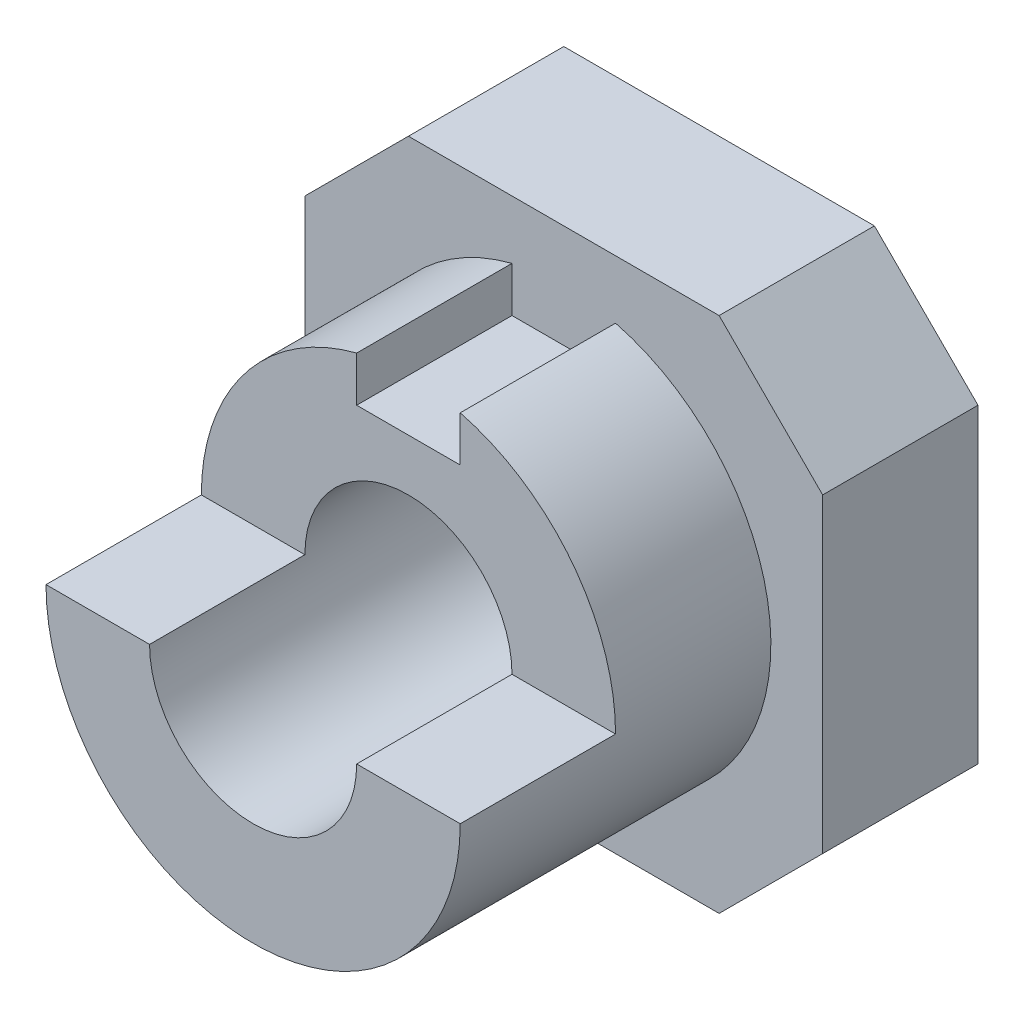
ISO-10303-21;
HEADER;
FILE_DESCRIPTION(('STEP AP214'),'2;1');
FILE_NAME('part.step','',(''),(''),'','','');
FILE_SCHEMA(('AUTOMOTIVE_DESIGN { 1 0 10303 214 1 1 1 1 }'));
ENDSEC;
DATA;
#1=APPLICATION_CONTEXT('core data for automotive mechanical design processes');
#2=APPLICATION_PROTOCOL_DEFINITION('international standard','automotive_design',2000,#1);
#3=PRODUCT_CONTEXT('',#1,'mechanical');
#4=PRODUCT('Part','Part','',(#3));
#5=PRODUCT_RELATED_PRODUCT_CATEGORY('part','',(#4));
#6=PRODUCT_DEFINITION_FORMATION('','',#4);
#7=PRODUCT_DEFINITION_CONTEXT('part definition',#1,'design');
#8=PRODUCT_DEFINITION('design','',#6,#7);
#9=PRODUCT_DEFINITION_SHAPE('','',#8);
#10=(LENGTH_UNIT() NAMED_UNIT(*) SI_UNIT(.MILLI.,.METRE.));
#11=(NAMED_UNIT(*) PLANE_ANGLE_UNIT() SI_UNIT($,.RADIAN.));
#12=(NAMED_UNIT(*) SI_UNIT($,.STERADIAN.) SOLID_ANGLE_UNIT());
#13=UNCERTAINTY_MEASURE_WITH_UNIT(LENGTH_MEASURE(1.E-05),#10,'distance_accuracy_value','');
#14=(GEOMETRIC_REPRESENTATION_CONTEXT(3) GLOBAL_UNCERTAINTY_ASSIGNED_CONTEXT((#13)) GLOBAL_UNIT_ASSIGNED_CONTEXT((#10,
#11,#12)) REPRESENTATION_CONTEXT('',''));
#15=CARTESIAN_POINT('',(0.,0.,0.));
#16=DIRECTION('',(0.,0.,1.));
#17=DIRECTION('',(1.,0.,0.));
#18=AXIS2_PLACEMENT_3D('',#15,#16,#17);
#19=CARTESIAN_POINT('',(0.,0.,3.));
#20=DIRECTION('',(0.,0.,-1.));
#21=DIRECTION('',(-1.,0.,0.));
#22=AXIS2_PLACEMENT_3D('',#19,#20,#21);
#23=PLANE('',#22);
#24=DIRECTION('',(0.,-1.,0.));
#25=VECTOR('',#24,1.);
#26=CARTESIAN_POINT('',(-5.,-3.,3.));
#27=LINE('',#26,#25);
#28=CARTESIAN_POINT('',(-5.,3.,3.));
#29=VERTEX_POINT('',#28);
#30=CARTESIAN_POINT('',(-5.,-3.,3.));
#31=VERTEX_POINT('',#30);
#32=EDGE_CURVE('E210',#29,#31,#27,.T.);
#33=ORIENTED_EDGE('',*,*,#32,.T.);
#34=DIRECTION('',(0.707106781186548,-0.707106781186548,0.));
#35=VECTOR('',#34,1.);
#36=CARTESIAN_POINT('',(-5.,-3.,3.));
#37=LINE('',#36,#35);
#38=CARTESIAN_POINT('',(-3.,-5.,3.));
#39=VERTEX_POINT('',#38);
#40=EDGE_CURVE('E213',#31,#39,#37,.T.);
#41=ORIENTED_EDGE('',*,*,#40,.T.);
#42=DIRECTION('',(1.,0.,0.));
#43=VECTOR('',#42,1.);
#44=CARTESIAN_POINT('',(-3.,-5.,3.));
#45=LINE('',#44,#43);
#46=CARTESIAN_POINT('',(3.,-5.,3.));
#47=VERTEX_POINT('',#46);
#48=EDGE_CURVE('E216',#39,#47,#45,.T.);
#49=ORIENTED_EDGE('',*,*,#48,.T.);
#50=DIRECTION('',(0.707106781186548,0.707106781186548,0.));
#51=VECTOR('',#50,1.);
#52=CARTESIAN_POINT('',(3.,-5.,3.));
#53=LINE('',#52,#51);
#54=CARTESIAN_POINT('',(5.,-3.,3.));
#55=VERTEX_POINT('',#54);
#56=EDGE_CURVE('E218',#47,#55,#53,.T.);
#57=ORIENTED_EDGE('',*,*,#56,.T.);
#58=DIRECTION('',(0.,1.,0.));
#59=VECTOR('',#58,1.);
#60=CARTESIAN_POINT('',(5.,-3.,3.));
#61=LINE('',#60,#59);
#62=CARTESIAN_POINT('',(5.,3.,3.));
#63=VERTEX_POINT('',#62);
#64=EDGE_CURVE('E220',#55,#63,#61,.T.);
#65=ORIENTED_EDGE('',*,*,#64,.T.);
#66=DIRECTION('',(-0.707106781186548,0.707106781186548,0.));
#67=VECTOR('',#66,1.);
#68=CARTESIAN_POINT('',(3.,5.,3.));
#69=LINE('',#68,#67);
#70=CARTESIAN_POINT('',(3.,5.,3.));
#71=VERTEX_POINT('',#70);
#72=EDGE_CURVE('E222',#63,#71,#69,.T.);
#73=ORIENTED_EDGE('',*,*,#72,.T.);
#74=DIRECTION('',(-1.,0.,0.));
#75=VECTOR('',#74,1.);
#76=CARTESIAN_POINT('',(-3.,5.,3.));
#77=LINE('',#76,#75);
#78=CARTESIAN_POINT('',(-3.,5.,3.));
#79=VERTEX_POINT('',#78);
#80=EDGE_CURVE('E224',#71,#79,#77,.T.);
#81=ORIENTED_EDGE('',*,*,#80,.T.);
#82=DIRECTION('',(-0.707106781186548,-0.707106781186548,0.));
#83=VECTOR('',#82,1.);
#84=CARTESIAN_POINT('',(-5.,3.,3.));
#85=LINE('',#84,#83);
#86=EDGE_CURVE('E226',#79,#29,#85,.T.);
#87=ORIENTED_EDGE('',*,*,#86,.T.);
#88=EDGE_LOOP('',(#33,#41,#49,#57,#65,#73,#81,#87));
#89=FACE_BOUND('',#88,.T.);
#90=DIRECTION('',(0.,-1.,0.));
#91=VECTOR('',#90,1.);
#92=CARTESIAN_POINT('',(1.,3.,3.));
#93=LINE('',#92,#91);
#94=CARTESIAN_POINT('',(1.,3.87298334620742,3.));
#95=VERTEX_POINT('',#94);
#96=CARTESIAN_POINT('',(1.,3.,3.));
#97=VERTEX_POINT('',#96);
#98=EDGE_CURVE('E187',#95,#97,#93,.T.);
#99=ORIENTED_EDGE('',*,*,#98,.F.);
#100=CARTESIAN_POINT('',(0.,0.,3.));
#101=DIRECTION('',(0.,0.,1.));
#102=DIRECTION('',(1.,0.,0.));
#103=AXIS2_PLACEMENT_3D('',#100,#101,#102);
#104=CIRCLE('',#103,4.);
#105=CARTESIAN_POINT('',(-1.,3.87298334620742,3.));
#106=VERTEX_POINT('',#105);
#107=EDGE_CURVE('E189',#106,#95,#104,.T.);
#108=ORIENTED_EDGE('',*,*,#107,.F.);
#109=DIRECTION('',(0.,1.,0.));
#110=VECTOR('',#109,1.);
#111=CARTESIAN_POINT('',(-1.,3.,3.));
#112=LINE('',#111,#110);
#113=CARTESIAN_POINT('',(-1.,3.,3.));
#114=VERTEX_POINT('',#113);
#115=EDGE_CURVE('E194',#114,#106,#112,.T.);
#116=ORIENTED_EDGE('',*,*,#115,.F.);
#117=DIRECTION('',(-1.,0.,0.));
#118=VECTOR('',#117,1.);
#119=CARTESIAN_POINT('',(1.,3.,3.));
#120=LINE('',#119,#118);
#121=EDGE_CURVE('E191',#97,#114,#120,.T.);
#122=ORIENTED_EDGE('',*,*,#121,.F.);
#123=EDGE_LOOP('',(#99,#108,#116,#122));
#124=FACE_BOUND('',#123,.T.);
#125=ADVANCED_FACE('F33',(#89,#124),#23,.F.);
#126=CARTESIAN_POINT('',(0.,0.,0.));
#127=DIRECTION('',(0.,0.,-1.));
#128=DIRECTION('',(-1.,0.,0.));
#129=AXIS2_PLACEMENT_3D('',#126,#127,#128);
#130=PLANE('',#129);
#131=DIRECTION('',(0.,-1.,0.));
#132=VECTOR('',#131,1.);
#133=CARTESIAN_POINT('',(-5.,-3.,0.));
#134=LINE('',#133,#132);
#135=CARTESIAN_POINT('',(-5.,3.,0.));
#136=VERTEX_POINT('',#135);
#137=CARTESIAN_POINT('',(-5.,-3.,0.));
#138=VERTEX_POINT('',#137);
#139=EDGE_CURVE('E209',#136,#138,#134,.T.);
#140=ORIENTED_EDGE('',*,*,#139,.F.);
#141=DIRECTION('',(-0.707106781186548,-0.707106781186548,0.));
#142=VECTOR('',#141,1.);
#143=CARTESIAN_POINT('',(-5.,3.,0.));
#144=LINE('',#143,#142);
#145=CARTESIAN_POINT('',(-3.,5.,0.));
#146=VERTEX_POINT('',#145);
#147=EDGE_CURVE('E214',#146,#136,#144,.T.);
#148=ORIENTED_EDGE('',*,*,#147,.F.);
#149=DIRECTION('',(-1.,0.,0.));
#150=VECTOR('',#149,1.);
#151=CARTESIAN_POINT('',(-3.,5.,0.));
#152=LINE('',#151,#150);
#153=CARTESIAN_POINT('',(3.,5.,0.));
#154=VERTEX_POINT('',#153);
#155=EDGE_CURVE('E241',#154,#146,#152,.T.);
#156=ORIENTED_EDGE('',*,*,#155,.F.);
#157=DIRECTION('',(-0.707106781186548,0.707106781186548,0.));
#158=VECTOR('',#157,1.);
#159=CARTESIAN_POINT('',(3.,5.,0.));
#160=LINE('',#159,#158);
#161=CARTESIAN_POINT('',(5.,3.,0.));
#162=VERTEX_POINT('',#161);
#163=EDGE_CURVE('E239',#162,#154,#160,.T.);
#164=ORIENTED_EDGE('',*,*,#163,.F.);
#165=DIRECTION('',(0.,1.,0.));
#166=VECTOR('',#165,1.);
#167=CARTESIAN_POINT('',(5.,-3.,0.));
#168=LINE('',#167,#166);
#169=CARTESIAN_POINT('',(5.,-3.,0.));
#170=VERTEX_POINT('',#169);
#171=EDGE_CURVE('E237',#170,#162,#168,.T.);
#172=ORIENTED_EDGE('',*,*,#171,.F.);
#173=DIRECTION('',(0.707106781186548,0.707106781186548,0.));
#174=VECTOR('',#173,1.);
#175=CARTESIAN_POINT('',(3.,-5.,0.));
#176=LINE('',#175,#174);
#177=CARTESIAN_POINT('',(3.,-5.,0.));
#178=VERTEX_POINT('',#177);
#179=EDGE_CURVE('E235',#178,#170,#176,.T.);
#180=ORIENTED_EDGE('',*,*,#179,.F.);
#181=DIRECTION('',(1.,0.,0.));
#182=VECTOR('',#181,1.);
#183=CARTESIAN_POINT('',(-3.,-5.,0.));
#184=LINE('',#183,#182);
#185=CARTESIAN_POINT('',(-3.,-5.,0.));
#186=VERTEX_POINT('',#185);
#187=EDGE_CURVE('E233',#186,#178,#184,.T.);
#188=ORIENTED_EDGE('',*,*,#187,.F.);
#189=DIRECTION('',(0.707106781186548,-0.707106781186548,0.));
#190=VECTOR('',#189,1.);
#191=CARTESIAN_POINT('',(-5.,-3.,0.));
#192=LINE('',#191,#190);
#193=EDGE_CURVE('E231',#138,#186,#192,.T.);
#194=ORIENTED_EDGE('',*,*,#193,.F.);
#195=EDGE_LOOP('',(#140,#148,#156,#164,#172,#180,#188,#194));
#196=FACE_BOUND('',#195,.T.);
#197=CARTESIAN_POINT('',(0.,0.,0.));
#198=DIRECTION('',(0.,0.,1.));
#199=DIRECTION('',(1.,0.,0.));
#200=AXIS2_PLACEMENT_3D('',#197,#198,#199);
#201=CIRCLE('',#200,2.);
#202=CARTESIAN_POINT('',(2.,0.,0.));
#203=VERTEX_POINT('',#202);
#204=EDGE_CURVE('E206',#203,#203,#201,.T.);
#205=ORIENTED_EDGE('',*,*,#204,.T.);
#206=EDGE_LOOP('',(#205));
#207=FACE_BOUND('',#206,.T.);
#208=ADVANCED_FACE('F288',(#196,#207),#130,.T.);
#209=CARTESIAN_POINT('',(-5.,-3.,3.));
#210=DIRECTION('',(1.,0.,0.));
#211=DIRECTION('',(0.,0.,-1.));
#212=AXIS2_PLACEMENT_3D('',#209,#210,#211);
#213=PLANE('',#212);
#214=ORIENTED_EDGE('',*,*,#139,.T.);
#215=DIRECTION('',(0.,0.,-1.));
#216=VECTOR('',#215,1.);
#217=CARTESIAN_POINT('',(-5.,-3.,3.));
#218=LINE('',#217,#216);
#219=EDGE_CURVE('E263',#31,#138,#218,.T.);
#220=ORIENTED_EDGE('',*,*,#219,.F.);
#221=ORIENTED_EDGE('',*,*,#32,.F.);
#222=DIRECTION('',(0.,0.,-1.));
#223=VECTOR('',#222,1.);
#224=CARTESIAN_POINT('',(-5.,3.,3.));
#225=LINE('',#224,#223);
#226=EDGE_CURVE('E228',#29,#136,#225,.T.);
#227=ORIENTED_EDGE('',*,*,#226,.T.);
#228=EDGE_LOOP('',(#214,#220,#221,#227));
#229=FACE_BOUND('',#228,.T.);
#230=ADVANCED_FACE('F35',(#229),#213,.F.);
#231=CARTESIAN_POINT('',(-5.,-3.,3.));
#232=DIRECTION('',(0.707106781186547,0.707106781186547,0.));
#233=DIRECTION('',(-0.707106781186548,0.707106781186548,0.));
#234=AXIS2_PLACEMENT_3D('',#231,#232,#233);
#235=PLANE('',#234);
#236=ORIENTED_EDGE('',*,*,#193,.T.);
#237=DIRECTION('',(0.,0.,-1.));
#238=VECTOR('',#237,1.);
#239=CARTESIAN_POINT('',(-3.,-5.,3.));
#240=LINE('',#239,#238);
#241=EDGE_CURVE('E261',#39,#186,#240,.T.);
#242=ORIENTED_EDGE('',*,*,#241,.F.);
#243=ORIENTED_EDGE('',*,*,#40,.F.);
#244=ORIENTED_EDGE('',*,*,#219,.T.);
#245=EDGE_LOOP('',(#236,#242,#243,#244));
#246=FACE_BOUND('',#245,.T.);
#247=ADVANCED_FACE('F322',(#246),#235,.F.);
#248=CARTESIAN_POINT('',(-3.,-5.,3.));
#249=DIRECTION('',(0.,1.,0.));
#250=DIRECTION('',(0.,0.,1.));
#251=AXIS2_PLACEMENT_3D('',#248,#249,#250);
#252=PLANE('',#251);
#253=ORIENTED_EDGE('',*,*,#187,.T.);
#254=DIRECTION('',(0.,0.,-1.));
#255=VECTOR('',#254,1.);
#256=CARTESIAN_POINT('',(3.,-5.,3.));
#257=LINE('',#256,#255);
#258=EDGE_CURVE('E258',#47,#178,#257,.T.);
#259=ORIENTED_EDGE('',*,*,#258,.F.);
#260=ORIENTED_EDGE('',*,*,#48,.F.);
#261=ORIENTED_EDGE('',*,*,#241,.T.);
#262=EDGE_LOOP('',(#253,#259,#260,#261));
#263=FACE_BOUND('',#262,.T.);
#264=ADVANCED_FACE('F319',(#263),#252,.F.);
#265=CARTESIAN_POINT('',(3.,-5.,3.));
#266=DIRECTION('',(-0.707106781186547,0.707106781186547,0.));
#267=DIRECTION('',(-0.707106781186548,-0.707106781186548,0.));
#268=AXIS2_PLACEMENT_3D('',#265,#266,#267);
#269=PLANE('',#268);
#270=ORIENTED_EDGE('',*,*,#179,.T.);
#271=DIRECTION('',(0.,0.,-1.));
#272=VECTOR('',#271,1.);
#273=CARTESIAN_POINT('',(5.,-3.,3.));
#274=LINE('',#273,#272);
#275=EDGE_CURVE('E255',#55,#170,#274,.T.);
#276=ORIENTED_EDGE('',*,*,#275,.F.);
#277=ORIENTED_EDGE('',*,*,#56,.F.);
#278=ORIENTED_EDGE('',*,*,#258,.T.);
#279=EDGE_LOOP('',(#270,#276,#277,#278));
#280=FACE_BOUND('',#279,.T.);
#281=ADVANCED_FACE('F315',(#280),#269,.F.);
#282=CARTESIAN_POINT('',(5.,-3.,3.));
#283=DIRECTION('',(-1.,0.,0.));
#284=DIRECTION('',(0.,0.,1.));
#285=AXIS2_PLACEMENT_3D('',#282,#283,#284);
#286=PLANE('',#285);
#287=ORIENTED_EDGE('',*,*,#171,.T.);
#288=DIRECTION('',(0.,0.,-1.));
#289=VECTOR('',#288,1.);
#290=CARTESIAN_POINT('',(5.,3.,3.));
#291=LINE('',#290,#289);
#292=EDGE_CURVE('E252',#63,#162,#291,.T.);
#293=ORIENTED_EDGE('',*,*,#292,.F.);
#294=ORIENTED_EDGE('',*,*,#64,.F.);
#295=ORIENTED_EDGE('',*,*,#275,.T.);
#296=EDGE_LOOP('',(#287,#293,#294,#295));
#297=FACE_BOUND('',#296,.T.);
#298=ADVANCED_FACE('F311',(#297),#286,.F.);
#299=CARTESIAN_POINT('',(3.,5.,3.));
#300=DIRECTION('',(-0.707106781186547,-0.707106781186547,0.));
#301=DIRECTION('',(0.707106781186548,-0.707106781186548,0.));
#302=AXIS2_PLACEMENT_3D('',#299,#300,#301);
#303=PLANE('',#302);
#304=ORIENTED_EDGE('',*,*,#163,.T.);
#305=DIRECTION('',(0.,0.,-1.));
#306=VECTOR('',#305,1.);
#307=CARTESIAN_POINT('',(3.,5.,3.));
#308=LINE('',#307,#306);
#309=EDGE_CURVE('E249',#71,#154,#308,.T.);
#310=ORIENTED_EDGE('',*,*,#309,.F.);
#311=ORIENTED_EDGE('',*,*,#72,.F.);
#312=ORIENTED_EDGE('',*,*,#292,.T.);
#313=EDGE_LOOP('',(#304,#310,#311,#312));
#314=FACE_BOUND('',#313,.T.);
#315=ADVANCED_FACE('F307',(#314),#303,.F.);
#316=CARTESIAN_POINT('',(-3.,5.,3.));
#317=DIRECTION('',(0.,-1.,0.));
#318=DIRECTION('',(0.,0.,-1.));
#319=AXIS2_PLACEMENT_3D('',#316,#317,#318);
#320=PLANE('',#319);
#321=ORIENTED_EDGE('',*,*,#155,.T.);
#322=DIRECTION('',(0.,0.,-1.));
#323=VECTOR('',#322,1.);
#324=CARTESIAN_POINT('',(-3.,5.,3.));
#325=LINE('',#324,#323);
#326=EDGE_CURVE('E246',#79,#146,#325,.T.);
#327=ORIENTED_EDGE('',*,*,#326,.F.);
#328=ORIENTED_EDGE('',*,*,#80,.F.);
#329=ORIENTED_EDGE('',*,*,#309,.T.);
#330=EDGE_LOOP('',(#321,#327,#328,#329));
#331=FACE_BOUND('',#330,.T.);
#332=ADVANCED_FACE('F303',(#331),#320,.F.);
#333=CARTESIAN_POINT('',(-5.,3.,3.));
#334=DIRECTION('',(0.707106781186547,-0.707106781186547,0.));
#335=DIRECTION('',(0.707106781186548,0.707106781186548,0.));
#336=AXIS2_PLACEMENT_3D('',#333,#334,#335);
#337=PLANE('',#336);
#338=ORIENTED_EDGE('',*,*,#147,.T.);
#339=ORIENTED_EDGE('',*,*,#226,.F.);
#340=ORIENTED_EDGE('',*,*,#86,.F.);
#341=ORIENTED_EDGE('',*,*,#326,.T.);
#342=EDGE_LOOP('',(#338,#339,#340,#341));
#343=FACE_BOUND('',#342,.T.);
#344=ADVANCED_FACE('F300',(#343),#337,.F.);
#345=CARTESIAN_POINT('',(0.,0.,3.));
#346=DIRECTION('',(0.,0.,-1.));
#347=DIRECTION('',(-1.,0.,0.));
#348=AXIS2_PLACEMENT_3D('',#345,#346,#347);
#349=CYLINDRICAL_SURFACE('',#348,2.);
#350=DIRECTION('',(0.,0.,-1.));
#351=VECTOR('',#350,1.);
#352=CARTESIAN_POINT('',(-2.,0.,3.));
#353=LINE('',#352,#351);
#354=CARTESIAN_POINT('',(-2.,0.,9.));
#355=VERTEX_POINT('',#354);
#356=CARTESIAN_POINT('',(-2.,0.,6.));
#357=VERTEX_POINT('',#356);
#358=EDGE_CURVE('E162',#355,#357,#353,.T.);
#359=ORIENTED_EDGE('',*,*,#358,.F.);
#360=CARTESIAN_POINT('',(0.,0.,9.));
#361=DIRECTION('',(0.,0.,1.));
#362=DIRECTION('',(1.,0.,0.));
#363=AXIS2_PLACEMENT_3D('',#360,#361,#362);
#364=CIRCLE('',#363,2.);
#365=CARTESIAN_POINT('',(2.,0.,9.));
#366=VERTEX_POINT('',#365);
#367=EDGE_CURVE('E184',#355,#366,#364,.T.);
#368=ORIENTED_EDGE('',*,*,#367,.T.);
#369=DIRECTION('',(0.,0.,-1.));
#370=VECTOR('',#369,1.);
#371=CARTESIAN_POINT('',(2.,0.,3.));
#372=LINE('',#371,#370);
#373=CARTESIAN_POINT('',(2.,0.,6.));
#374=VERTEX_POINT('',#373);
#375=EDGE_CURVE('E181',#374,#366,#372,.F.);
#376=ORIENTED_EDGE('',*,*,#375,.F.);
#377=CARTESIAN_POINT('',(0.,0.,6.));
#378=DIRECTION('',(0.,0.,-1.));
#379=DIRECTION('',(-1.,0.,0.));
#380=AXIS2_PLACEMENT_3D('',#377,#378,#379);
#381=CIRCLE('',#380,2.);
#382=EDGE_CURVE('E179',#357,#374,#381,.T.);
#383=ORIENTED_EDGE('',*,*,#382,.F.);
#384=EDGE_LOOP('',(#359,#368,#376,#383));
#385=FACE_BOUND('',#384,.T.);
#386=ORIENTED_EDGE('',*,*,#204,.F.);
#387=EDGE_LOOP('',(#386));
#388=FACE_BOUND('',#387,.T.);
#389=ADVANCED_FACE('F297',(#385,#388),#349,.F.);
#390=CARTESIAN_POINT('',(0.,0.,9.));
#391=DIRECTION('',(0.,0.,1.));
#392=DIRECTION('',(1.,0.,0.));
#393=AXIS2_PLACEMENT_3D('',#390,#391,#392);
#394=PLANE('',#393);
#395=DIRECTION('',(1.,0.,0.));
#396=VECTOR('',#395,1.);
#397=CARTESIAN_POINT('',(-4.,0.,9.));
#398=LINE('',#397,#396);
#399=CARTESIAN_POINT('',(-4.,0.,9.));
#400=VERTEX_POINT('',#399);
#401=EDGE_CURVE('E364',#400,#355,#398,.T.);
#402=ORIENTED_EDGE('',*,*,#401,.F.);
#403=CARTESIAN_POINT('',(0.,0.,9.));
#404=DIRECTION('',(0.,0.,1.));
#405=DIRECTION('',(1.,0.,0.));
#406=AXIS2_PLACEMENT_3D('',#403,#404,#405);
#407=CIRCLE('',#406,4.);
#408=CARTESIAN_POINT('',(4.,0.,9.));
#409=VERTEX_POINT('',#408);
#410=EDGE_CURVE('E168',#400,#409,#407,.T.);
#411=ORIENTED_EDGE('',*,*,#410,.T.);
#412=EDGE_CURVE('E365',#366,#409,#398,.T.);
#413=ORIENTED_EDGE('',*,*,#412,.F.);
#414=ORIENTED_EDGE('',*,*,#367,.F.);
#415=EDGE_LOOP('',(#402,#411,#413,#414));
#416=FACE_BOUND('',#415,.T.);
#417=ADVANCED_FACE('F354',(#416),#394,.T.);
#418=CARTESIAN_POINT('',(1.,3.,9.));
#419=DIRECTION('',(1.,0.,0.));
#420=DIRECTION('',(0.,0.,-1.));
#421=AXIS2_PLACEMENT_3D('',#418,#419,#420);
#422=PLANE('',#421);
#423=DIRECTION('',(0.,0.,-1.));
#424=VECTOR('',#423,1.);
#425=CARTESIAN_POINT('',(1.,3.,9.));
#426=LINE('',#425,#424);
#427=CARTESIAN_POINT('',(1.,3.,6.));
#428=VERTEX_POINT('',#427);
#429=EDGE_CURVE('E204',#428,#97,#426,.T.);
#430=ORIENTED_EDGE('',*,*,#429,.F.);
#431=DIRECTION('',(0.,1.,0.));
#432=VECTOR('',#431,1.);
#433=CARTESIAN_POINT('',(1.,3.,6.));
#434=LINE('',#433,#432);
#435=CARTESIAN_POINT('',(1.,3.87298334620742,6.));
#436=VERTEX_POINT('',#435);
#437=EDGE_CURVE('E170',#428,#436,#434,.T.);
#438=ORIENTED_EDGE('',*,*,#437,.T.);
#439=DIRECTION('',(0.,0.,-1.));
#440=VECTOR('',#439,1.);
#441=CARTESIAN_POINT('',(1.,3.87298334620742,9.));
#442=LINE('',#441,#440);
#443=EDGE_CURVE('E56',#436,#95,#442,.T.);
#444=ORIENTED_EDGE('',*,*,#443,.T.);
#445=ORIENTED_EDGE('',*,*,#98,.T.);
#446=EDGE_LOOP('',(#430,#438,#444,#445));
#447=FACE_BOUND('',#446,.T.);
#448=ADVANCED_FACE('F269',(#447),#422,.F.);
#449=CARTESIAN_POINT('',(1.,3.,9.));
#450=DIRECTION('',(0.,-1.,0.));
#451=DIRECTION('',(0.,0.,-1.));
#452=AXIS2_PLACEMENT_3D('',#449,#450,#451);
#453=PLANE('',#452);
#454=DIRECTION('',(0.,0.,-1.));
#455=VECTOR('',#454,1.);
#456=CARTESIAN_POINT('',(-1.,3.,9.));
#457=LINE('',#456,#455);
#458=CARTESIAN_POINT('',(-1.,3.,6.));
#459=VERTEX_POINT('',#458);
#460=EDGE_CURVE('E202',#459,#114,#457,.T.);
#461=ORIENTED_EDGE('',*,*,#460,.F.);
#462=DIRECTION('',(1.,0.,0.));
#463=VECTOR('',#462,1.);
#464=CARTESIAN_POINT('',(1.,3.,6.));
#465=LINE('',#464,#463);
#466=EDGE_CURVE('E175',#459,#428,#465,.T.);
#467=ORIENTED_EDGE('',*,*,#466,.T.);
#468=ORIENTED_EDGE('',*,*,#429,.T.);
#469=ORIENTED_EDGE('',*,*,#121,.T.);
#470=EDGE_LOOP('',(#461,#467,#468,#469));
#471=FACE_BOUND('',#470,.T.);
#472=ADVANCED_FACE('F273',(#471),#453,.F.);
#473=CARTESIAN_POINT('',(-1.,3.,9.));
#474=DIRECTION('',(-1.,0.,0.));
#475=DIRECTION('',(0.,-1.,0.));
#476=AXIS2_PLACEMENT_3D('',#473,#474,#475);
#477=PLANE('',#476);
#478=DIRECTION('',(0.,0.,-1.));
#479=VECTOR('',#478,1.);
#480=CARTESIAN_POINT('',(-1.,3.87298334620742,9.));
#481=LINE('',#480,#479);
#482=CARTESIAN_POINT('',(-1.,3.87298334620742,6.));
#483=VERTEX_POINT('',#482);
#484=EDGE_CURVE('E200',#483,#106,#481,.T.);
#485=ORIENTED_EDGE('',*,*,#484,.F.);
#486=DIRECTION('',(0.,-1.,0.));
#487=VECTOR('',#486,1.);
#488=CARTESIAN_POINT('',(-1.,3.,6.));
#489=LINE('',#488,#487);
#490=EDGE_CURVE('E153',#483,#459,#489,.T.);
#491=ORIENTED_EDGE('',*,*,#490,.T.);
#492=ORIENTED_EDGE('',*,*,#460,.T.);
#493=ORIENTED_EDGE('',*,*,#115,.T.);
#494=EDGE_LOOP('',(#485,#491,#492,#493));
#495=FACE_BOUND('',#494,.T.);
#496=ADVANCED_FACE('F278',(#495),#477,.F.);
#497=CARTESIAN_POINT('',(0.,0.,9.));
#498=DIRECTION('',(0.,0.,-1.));
#499=DIRECTION('',(-1.,0.,0.));
#500=AXIS2_PLACEMENT_3D('',#497,#498,#499);
#501=CYLINDRICAL_SURFACE('',#500,4.);
#502=ORIENTED_EDGE('',*,*,#410,.F.);
#503=DIRECTION('',(0.,0.,1.));
#504=VECTOR('',#503,1.);
#505=CARTESIAN_POINT('',(-4.,0.,6.));
#506=LINE('',#505,#504);
#507=CARTESIAN_POINT('',(-4.,0.,6.));
#508=VERTEX_POINT('',#507);
#509=EDGE_CURVE('E159',#508,#400,#506,.T.);
#510=ORIENTED_EDGE('',*,*,#509,.F.);
#511=CARTESIAN_POINT('',(0.,0.,6.));
#512=DIRECTION('',(0.,0.,-1.));
#513=DIRECTION('',(-1.,0.,0.));
#514=AXIS2_PLACEMENT_3D('',#511,#512,#513);
#515=CIRCLE('',#514,4.);
#516=EDGE_CURVE('E11',#508,#483,#515,.T.);
#517=ORIENTED_EDGE('',*,*,#516,.T.);
#518=ORIENTED_EDGE('',*,*,#484,.T.);
#519=ORIENTED_EDGE('',*,*,#107,.T.);
#520=ORIENTED_EDGE('',*,*,#443,.F.);
#521=CARTESIAN_POINT('',(4.,0.,6.));
#522=VERTEX_POINT('',#521);
#523=EDGE_CURVE('E37',#436,#522,#515,.T.);
#524=ORIENTED_EDGE('',*,*,#523,.T.);
#525=DIRECTION('',(0.,0.,1.));
#526=VECTOR('',#525,1.);
#527=CARTESIAN_POINT('',(4.,0.,6.));
#528=LINE('',#527,#526);
#529=EDGE_CURVE('E48',#522,#409,#528,.T.);
#530=ORIENTED_EDGE('',*,*,#529,.T.);
#531=EDGE_LOOP('',(#502,#510,#517,#518,#519,#520,#524,#530));
#532=FACE_BOUND('',#531,.T.);
#533=ADVANCED_FACE('F166',(#532),#501,.T.);
#534=CARTESIAN_POINT('',(-4.,0.,6.));
#535=DIRECTION('',(0.,-1.,0.));
#536=DIRECTION('',(0.,0.,-1.));
#537=AXIS2_PLACEMENT_3D('',#534,#535,#536);
#538=PLANE('',#537);
#539=ORIENTED_EDGE('',*,*,#358,.T.);
#540=DIRECTION('',(1.,0.,0.));
#541=VECTOR('',#540,1.);
#542=CARTESIAN_POINT('',(-4.,0.,6.));
#543=LINE('',#542,#541);
#544=EDGE_CURVE('E150',#508,#357,#543,.T.);
#545=ORIENTED_EDGE('',*,*,#544,.F.);
#546=ORIENTED_EDGE('',*,*,#509,.T.);
#547=ORIENTED_EDGE('',*,*,#401,.T.);
#548=EDGE_LOOP('',(#539,#545,#546,#547));
#549=FACE_BOUND('',#548,.T.);
#550=ADVANCED_FACE('F158',(#549),#538,.F.);
#551=CARTESIAN_POINT('',(0.,0.,6.));
#552=DIRECTION('',(0.,0.,-1.));
#553=DIRECTION('',(-1.,0.,0.));
#554=AXIS2_PLACEMENT_3D('',#551,#552,#553);
#555=PLANE('',#554);
#556=ORIENTED_EDGE('',*,*,#382,.T.);
#557=EDGE_CURVE('E163',#374,#522,#543,.T.);
#558=ORIENTED_EDGE('',*,*,#557,.T.);
#559=ORIENTED_EDGE('',*,*,#523,.F.);
#560=ORIENTED_EDGE('',*,*,#437,.F.);
#561=ORIENTED_EDGE('',*,*,#466,.F.);
#562=ORIENTED_EDGE('',*,*,#490,.F.);
#563=ORIENTED_EDGE('',*,*,#516,.F.);
#564=ORIENTED_EDGE('',*,*,#544,.T.);
#565=EDGE_LOOP('',(#556,#558,#559,#560,#561,#562,#563,#564));
#566=FACE_BOUND('',#565,.T.);
#567=ADVANCED_FACE('F149',(#566),#555,.F.);
#568=ORIENTED_EDGE('',*,*,#375,.T.);
#569=ORIENTED_EDGE('',*,*,#412,.T.);
#570=ORIENTED_EDGE('',*,*,#529,.F.);
#571=ORIENTED_EDGE('',*,*,#557,.F.);
#572=EDGE_LOOP('',(#568,#569,#570,#571));
#573=FACE_BOUND('',#572,.T.);
#574=ADVANCED_FACE('F366',(#573),#538,.F.);
#575=CLOSED_SHELL('',(#125,#208,#230,#247,#264,#281,#298,#315,#332,#344,#389,#417,#448,#472,
#496,#533,#550,#567,#574));
#576=MANIFOLD_SOLID_BREP('B2',#575);
#577=ADVANCED_BREP_SHAPE_REPRESENTATION('',(#18,#576),#14);
#578=SHAPE_DEFINITION_REPRESENTATION(#9,#577);
ENDSEC;
END-ISO-10303-21;
